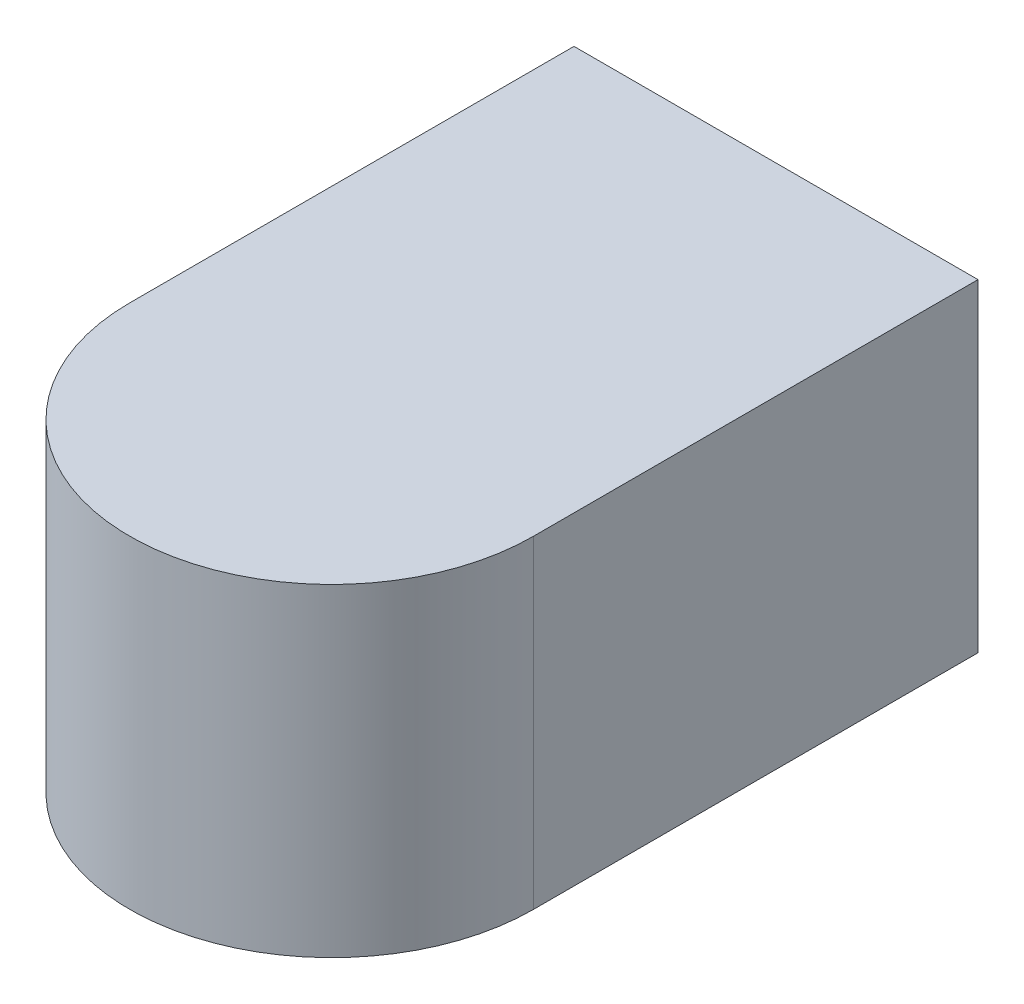
ISO-10303-21;
HEADER;
FILE_DESCRIPTION(('STEP AP214'),'2;1');
FILE_NAME('part.step','',(''),(''),'','','');
FILE_SCHEMA(('AUTOMOTIVE_DESIGN { 1 0 10303 214 1 1 1 1 }'));
ENDSEC;
DATA;
#1=APPLICATION_CONTEXT('core data for automotive mechanical design processes');
#2=APPLICATION_PROTOCOL_DEFINITION('international standard','automotive_design',2000,#1);
#3=PRODUCT_CONTEXT('',#1,'mechanical');
#4=PRODUCT('Part','Part','',(#3));
#5=PRODUCT_RELATED_PRODUCT_CATEGORY('part','',(#4));
#6=PRODUCT_DEFINITION_FORMATION('','',#4);
#7=PRODUCT_DEFINITION_CONTEXT('part definition',#1,'design');
#8=PRODUCT_DEFINITION('design','',#6,#7);
#9=PRODUCT_DEFINITION_SHAPE('','',#8);
#10=(LENGTH_UNIT() NAMED_UNIT(*) SI_UNIT(.MILLI.,.METRE.));
#11=(NAMED_UNIT(*) PLANE_ANGLE_UNIT() SI_UNIT($,.RADIAN.));
#12=(NAMED_UNIT(*) SI_UNIT($,.STERADIAN.) SOLID_ANGLE_UNIT());
#13=UNCERTAINTY_MEASURE_WITH_UNIT(LENGTH_MEASURE(1.E-05),#10,'distance_accuracy_value','');
#14=(GEOMETRIC_REPRESENTATION_CONTEXT(3) GLOBAL_UNCERTAINTY_ASSIGNED_CONTEXT((#13)) GLOBAL_UNIT_ASSIGNED_CONTEXT((#10,
#11,#12)) REPRESENTATION_CONTEXT('',''));
#15=CARTESIAN_POINT('',(0.,0.,0.));
#16=DIRECTION('',(0.,0.,1.));
#17=DIRECTION('',(1.,0.,0.));
#18=AXIS2_PLACEMENT_3D('',#15,#16,#17);
#19=CARTESIAN_POINT('',(0.,0.,0.));
#20=DIRECTION('',(0.,1.,0.));
#21=DIRECTION('',(1.,0.,0.));
#22=AXIS2_PLACEMENT_3D('',#19,#20,#21);
#23=PLANE('',#22);
#24=DIRECTION('',(-1.,0.,0.));
#25=VECTOR('',#24,1.);
#26=CARTESIAN_POINT('',(-0.625,0.,-1.5));
#27=LINE('',#26,#25);
#28=CARTESIAN_POINT('',(-0.625,0.,-1.5));
#29=VERTEX_POINT('',#28);
#30=CARTESIAN_POINT('',(-0.875,0.,-1.5));
#31=VERTEX_POINT('',#30);
#32=EDGE_CURVE('E11',#29,#31,#27,.T.);
#33=ORIENTED_EDGE('',*,*,#32,.F.);
#34=DIRECTION('',(0.,0.,-1.));
#35=VECTOR('',#34,1.);
#36=CARTESIAN_POINT('',(-0.625,0.,-1.225));
#37=LINE('',#36,#35);
#38=CARTESIAN_POINT('',(-0.625,0.,-1.225));
#39=VERTEX_POINT('',#38);
#40=EDGE_CURVE('E24',#39,#29,#37,.T.);
#41=ORIENTED_EDGE('',*,*,#40,.F.);
#42=CARTESIAN_POINT('',(-0.75,0.,-1.225));
#43=DIRECTION('',(0.,1.,0.));
#44=DIRECTION('',(-1.,0.,0.));
#45=AXIS2_PLACEMENT_3D('',#42,#43,#44);
#46=CIRCLE('',#45,0.125);
#47=CARTESIAN_POINT('',(-0.875,0.,-1.225));
#48=VERTEX_POINT('',#47);
#49=EDGE_CURVE('E61',#48,#39,#46,.T.);
#50=ORIENTED_EDGE('',*,*,#49,.F.);
#51=DIRECTION('',(0.,0.,1.));
#52=VECTOR('',#51,1.);
#53=CARTESIAN_POINT('',(-0.875,0.,-1.5));
#54=LINE('',#53,#52);
#55=EDGE_CURVE('E37',#31,#48,#54,.T.);
#56=ORIENTED_EDGE('',*,*,#55,.F.);
#57=EDGE_LOOP('',(#33,#41,#50,#56));
#58=FACE_BOUND('',#57,.T.);
#59=ADVANCED_FACE('F17',(#58),#23,.F.);
#60=CARTESIAN_POINT('',(-0.875,0.,-1.5));
#61=DIRECTION('',(-1.,0.,0.));
#62=DIRECTION('',(0.,0.,1.));
#63=AXIS2_PLACEMENT_3D('',#60,#61,#62);
#64=PLANE('',#63);
#65=DIRECTION('',(0.,1.,0.));
#66=VECTOR('',#65,1.);
#67=CARTESIAN_POINT('',(-0.875,0.,-1.225));
#68=LINE('',#67,#66);
#69=CARTESIAN_POINT('',(-0.875,0.2,-1.225));
#70=VERTEX_POINT('',#69);
#71=EDGE_CURVE('E84',#48,#70,#68,.T.);
#72=ORIENTED_EDGE('',*,*,#71,.T.);
#73=DIRECTION('',(0.,0.,1.));
#74=VECTOR('',#73,1.);
#75=CARTESIAN_POINT('',(-0.875,0.2,-1.5));
#76=LINE('',#75,#74);
#77=CARTESIAN_POINT('',(-0.875,0.2,-1.5));
#78=VERTEX_POINT('',#77);
#79=EDGE_CURVE('E74',#78,#70,#76,.T.);
#80=ORIENTED_EDGE('',*,*,#79,.F.);
#81=DIRECTION('',(0.,1.,0.));
#82=VECTOR('',#81,1.);
#83=CARTESIAN_POINT('',(-0.875,0.,-1.5));
#84=LINE('',#83,#82);
#85=EDGE_CURVE('E81',#31,#78,#84,.T.);
#86=ORIENTED_EDGE('',*,*,#85,.F.);
#87=ORIENTED_EDGE('',*,*,#55,.T.);
#88=EDGE_LOOP('',(#72,#80,#86,#87));
#89=FACE_BOUND('',#88,.T.);
#90=ADVANCED_FACE('F89',(#89),#64,.T.);
#91=CARTESIAN_POINT('',(-0.625,0.,-1.5));
#92=DIRECTION('',(0.,0.,-1.));
#93=DIRECTION('',(-1.,0.,0.));
#94=AXIS2_PLACEMENT_3D('',#91,#92,#93);
#95=PLANE('',#94);
#96=ORIENTED_EDGE('',*,*,#85,.T.);
#97=DIRECTION('',(-1.,0.,0.));
#98=VECTOR('',#97,1.);
#99=CARTESIAN_POINT('',(-0.625,0.2,-1.5));
#100=LINE('',#99,#98);
#101=CARTESIAN_POINT('',(-0.625,0.2,-1.5));
#102=VERTEX_POINT('',#101);
#103=EDGE_CURVE('E79',#102,#78,#100,.T.);
#104=ORIENTED_EDGE('',*,*,#103,.F.);
#105=DIRECTION('',(0.,1.,0.));
#106=VECTOR('',#105,1.);
#107=CARTESIAN_POINT('',(-0.625,0.,-1.5));
#108=LINE('',#107,#106);
#109=EDGE_CURVE('E67',#29,#102,#108,.T.);
#110=ORIENTED_EDGE('',*,*,#109,.F.);
#111=ORIENTED_EDGE('',*,*,#32,.T.);
#112=EDGE_LOOP('',(#96,#104,#110,#111));
#113=FACE_BOUND('',#112,.T.);
#114=ADVANCED_FACE('F91',(#113),#95,.T.);
#115=CARTESIAN_POINT('',(-0.625,0.,-1.225));
#116=DIRECTION('',(1.,0.,0.));
#117=DIRECTION('',(0.,0.,-1.));
#118=AXIS2_PLACEMENT_3D('',#115,#116,#117);
#119=PLANE('',#118);
#120=ORIENTED_EDGE('',*,*,#109,.T.);
#121=DIRECTION('',(0.,0.,-1.));
#122=VECTOR('',#121,1.);
#123=CARTESIAN_POINT('',(-0.625,0.2,-1.225));
#124=LINE('',#123,#122);
#125=CARTESIAN_POINT('',(-0.625,0.2,-1.225));
#126=VERTEX_POINT('',#125);
#127=EDGE_CURVE('E62',#126,#102,#124,.T.);
#128=ORIENTED_EDGE('',*,*,#127,.F.);
#129=DIRECTION('',(0.,1.,0.));
#130=VECTOR('',#129,1.);
#131=CARTESIAN_POINT('',(-0.625,0.,-1.225));
#132=LINE('',#131,#130);
#133=EDGE_CURVE('E55',#39,#126,#132,.T.);
#134=ORIENTED_EDGE('',*,*,#133,.F.);
#135=ORIENTED_EDGE('',*,*,#40,.T.);
#136=EDGE_LOOP('',(#120,#128,#134,#135));
#137=FACE_BOUND('',#136,.T.);
#138=ADVANCED_FACE('F65',(#137),#119,.T.);
#139=CARTESIAN_POINT('',(-0.75,0.,-1.225));
#140=DIRECTION('',(0.,1.,0.));
#141=DIRECTION('',(1.,0.,0.));
#142=AXIS2_PLACEMENT_3D('',#139,#140,#141);
#143=CYLINDRICAL_SURFACE('',#142,0.125);
#144=ORIENTED_EDGE('',*,*,#133,.T.);
#145=CARTESIAN_POINT('',(-0.75,0.2,-1.225));
#146=DIRECTION('',(0.,1.,0.));
#147=DIRECTION('',(-1.,0.,0.));
#148=AXIS2_PLACEMENT_3D('',#145,#146,#147);
#149=CIRCLE('',#148,0.125);
#150=EDGE_CURVE('E60',#70,#126,#149,.T.);
#151=ORIENTED_EDGE('',*,*,#150,.F.);
#152=ORIENTED_EDGE('',*,*,#71,.F.);
#153=ORIENTED_EDGE('',*,*,#49,.T.);
#154=EDGE_LOOP('',(#144,#151,#152,#153));
#155=FACE_BOUND('',#154,.T.);
#156=ADVANCED_FACE('F57',(#155),#143,.T.);
#157=CARTESIAN_POINT('',(0.,0.2,0.));
#158=DIRECTION('',(0.,1.,0.));
#159=DIRECTION('',(1.,0.,0.));
#160=AXIS2_PLACEMENT_3D('',#157,#158,#159);
#161=PLANE('',#160);
#162=ORIENTED_EDGE('',*,*,#150,.T.);
#163=ORIENTED_EDGE('',*,*,#127,.T.);
#164=ORIENTED_EDGE('',*,*,#103,.T.);
#165=ORIENTED_EDGE('',*,*,#79,.T.);
#166=EDGE_LOOP('',(#162,#163,#164,#165));
#167=FACE_BOUND('',#166,.T.);
#168=ADVANCED_FACE('F72',(#167),#161,.T.);
#169=CLOSED_SHELL('',(#59,#90,#114,#138,#156,#168));
#170=MANIFOLD_SOLID_BREP('B1',#169);
#171=ADVANCED_BREP_SHAPE_REPRESENTATION('',(#18,#170),#14);
#172=SHAPE_DEFINITION_REPRESENTATION(#9,#171);
ENDSEC;
END-ISO-10303-21;
